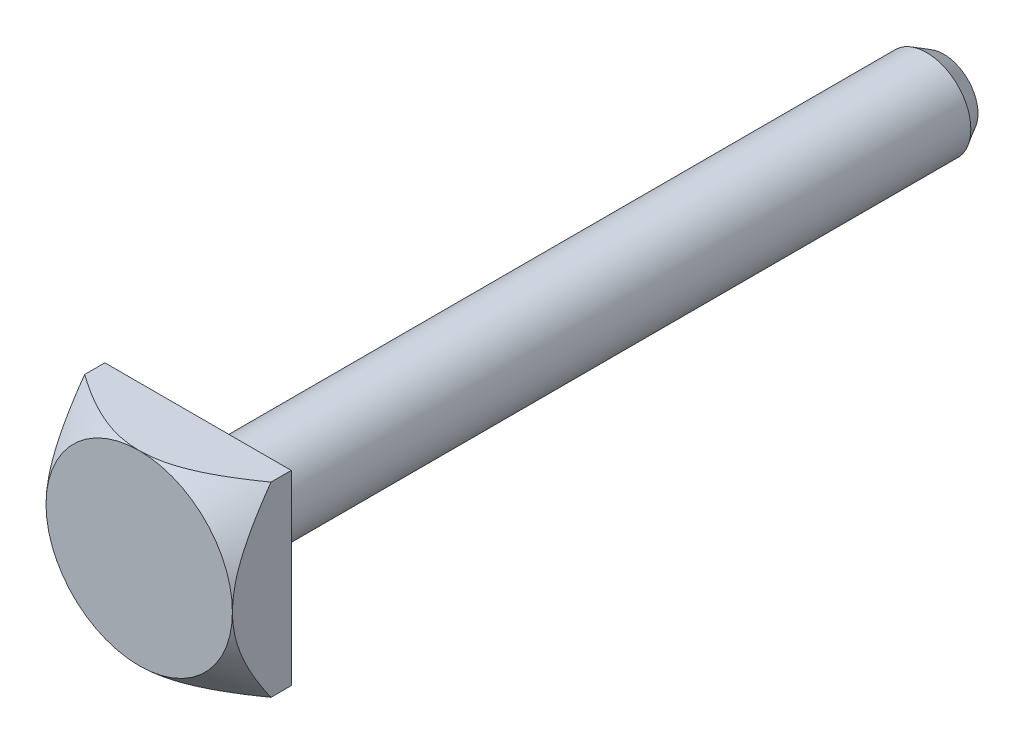
ISO-10303-21;
HEADER;
FILE_DESCRIPTION(('STEP AP214'),'2;1');
FILE_NAME('part.step','',(''),(''),'','','');
FILE_SCHEMA(('AUTOMOTIVE_DESIGN { 1 0 10303 214 1 1 1 1 }'));
ENDSEC;
DATA;
#1=APPLICATION_CONTEXT('core data for automotive mechanical design processes');
#2=APPLICATION_PROTOCOL_DEFINITION('international standard','automotive_design',2000,#1);
#3=PRODUCT_CONTEXT('',#1,'mechanical');
#4=PRODUCT('Part','Part','',(#3));
#5=PRODUCT_RELATED_PRODUCT_CATEGORY('part','',(#4));
#6=PRODUCT_DEFINITION_FORMATION('','',#4);
#7=PRODUCT_DEFINITION_CONTEXT('part definition',#1,'design');
#8=PRODUCT_DEFINITION('design','',#6,#7);
#9=PRODUCT_DEFINITION_SHAPE('','',#8);
#10=(LENGTH_UNIT() NAMED_UNIT(*) SI_UNIT(.MILLI.,.METRE.));
#11=(NAMED_UNIT(*) PLANE_ANGLE_UNIT() SI_UNIT($,.RADIAN.));
#12=(NAMED_UNIT(*) SI_UNIT($,.STERADIAN.) SOLID_ANGLE_UNIT());
#13=UNCERTAINTY_MEASURE_WITH_UNIT(LENGTH_MEASURE(1.E-05),#10,'distance_accuracy_value','');
#14=(GEOMETRIC_REPRESENTATION_CONTEXT(3) GLOBAL_UNCERTAINTY_ASSIGNED_CONTEXT((#13)) GLOBAL_UNIT_ASSIGNED_CONTEXT((#10,
#11,#12)) REPRESENTATION_CONTEXT('',''));
#15=CARTESIAN_POINT('',(0.,0.,0.));
#16=DIRECTION('',(0.,0.,1.));
#17=DIRECTION('',(1.,0.,0.));
#18=AXIS2_PLACEMENT_3D('',#15,#16,#17);
#19=CARTESIAN_POINT('',(9.5,9.5,82.));
#20=DIRECTION('',(-1.,0.,0.));
#21=DIRECTION('',(0.,-1.,0.));
#22=AXIS2_PLACEMENT_3D('',#19,#20,#21);
#23=PLANE('',#22);
#24=CARTESIAN_POINT('',(9.50000000000001,-19.4721665623452,69.8340065856256));
#25=CARTESIAN_POINT('',(9.50000000000001,-19.0306590831264,70.2307531037804));
#26=CARTESIAN_POINT('',(9.50000000000001,-18.5879086587408,70.6261284048615));
#27=CARTESIAN_POINT('',(9.50000000000001,-17.699269950547,71.4134110112182));
#28=CARTESIAN_POINT('',(9.50000000000001,-17.2533814043065,71.8053180201121));
#29=CARTESIAN_POINT('',(9.50000000000001,-16.3563490198093,72.5862116730046));
#30=CARTESIAN_POINT('',(9.50000000000001,-15.905192381029,72.9751836363947));
#31=CARTESIAN_POINT('',(9.50000000000001,-14.9983093091864,73.7477379709349));
#32=CARTESIAN_POINT('',(9.50000000000001,-14.5425830508741,74.1313205468474));
#33=CARTESIAN_POINT('',(9.50000000000001,-13.5993560046381,74.9132893945585));
#34=CARTESIAN_POINT('',(9.50000000000001,-13.1115229732712,75.311275727635));
#35=CARTESIAN_POINT('',(9.50000000000001,-12.1277405329228,76.0972630482586));
#36=CARTESIAN_POINT('',(9.50000000000001,-11.6317902090281,76.4852628973563));
#37=CARTESIAN_POINT('',(9.50000000000001,-10.8804318030354,77.0567459686463));
#38=CARTESIAN_POINT('',(9.50000000000001,-10.6289222453784,77.2453567322921));
#39=CARTESIAN_POINT('',(9.50000000000001,-10.1229368572879,77.6185515664923));
#40=CARTESIAN_POINT('',(9.50000000000001,-9.86846110495942,77.8031357427082));
#41=CARTESIAN_POINT('',(9.50000000000001,-9.35616825008921,78.1675029286436));
#42=CARTESIAN_POINT('',(9.50000000000001,-9.09835184545209,78.3472869179081));
#43=CARTESIAN_POINT('',(9.50000000000001,-8.57884607412315,78.7011557822078));
#44=CARTESIAN_POINT('',(9.50000000000001,-8.31715693942837,78.8752409966391));
#45=CARTESIAN_POINT('',(9.50000000000001,-7.85493474254647,79.1741271671386));
#46=CARTESIAN_POINT('',(9.50000000000001,-7.65536867977937,79.300422734887));
#47=CARTESIAN_POINT('',(9.50000000000001,-7.25345974520725,79.548528323));
#48=CARTESIAN_POINT('',(9.50000000000001,-7.05111686375619,79.6703383277773));
#49=CARTESIAN_POINT('',(9.50000000000001,-6.64328519100776,79.9088024302439));
#50=CARTESIAN_POINT('',(9.50000000000001,-6.43779503233453,80.0254541960909));
#51=CARTESIAN_POINT('',(9.50000000000001,-6.02347517551823,80.2526784688388));
#52=CARTESIAN_POINT('',(9.50000000000001,-5.81464550342015,80.3632510231218));
#53=CARTESIAN_POINT('',(9.50000000000001,-5.39518568595386,80.5763701796043));
#54=CARTESIAN_POINT('',(9.50000000000001,-5.18458695413664,80.6789781744367));
#55=CARTESIAN_POINT('',(9.50000000000001,-4.75961358581539,80.8760428240298));
#56=CARTESIAN_POINT('',(9.5,-4.5452386185349,80.9704987603988));
#57=CARTESIAN_POINT('',(9.5,-3.89645106853887,81.2395148348638));
#58=CARTESIAN_POINT('',(9.5,-3.45591373688126,81.3999642298198));
#59=CARTESIAN_POINT('',(9.5,-2.72872088080816,81.6194537870873));
#60=CARTESIAN_POINT('',(9.5,-2.44669929064959,81.6939169549311));
#61=CARTESIAN_POINT('',(9.5,-1.87758402609192,81.8202054365497));
#62=CARTESIAN_POINT('',(9.5,-1.59049118100718,81.8720344167332));
#63=CARTESIAN_POINT('',(9.5,-1.01382125890937,81.9503108271729));
#64=CARTESIAN_POINT('',(9.5,-0.72425607151271,81.9768446562656));
#65=CARTESIAN_POINT('',(9.5,-0.143893684117631,82.0033318956354));
#66=CARTESIAN_POINT('',(9.5,0.146903499507863,82.0032856580537));
#67=CARTESIAN_POINT('',(9.5,0.727182438330571,81.9766190152951));
#68=CARTESIAN_POINT('',(9.5,1.01666450475548,81.9500052660521));
#69=CARTESIAN_POINT('',(9.5,1.59218911977194,81.8717227256791));
#70=CARTESIAN_POINT('',(9.5,1.87823139125666,81.8200519296499));
#71=CARTESIAN_POINT('',(9.5,2.44645115463409,81.6939819093232));
#72=CARTESIAN_POINT('',(9.5,2.72860744462623,81.6194884074541));
#73=CARTESIAN_POINT('',(9.5,3.28695217314645,81.4509617358665));
#74=CARTESIAN_POINT('',(9.5,3.56314048453642,81.3569281503304));
#75=CARTESIAN_POINT('',(9.5,4.17331405632189,81.1284629056652));
#76=CARTESIAN_POINT('',(9.5,4.50567836116506,80.9897281434871));
#77=CARTESIAN_POINT('',(9.5,5.16145598433046,80.6923571745101));
#78=CARTESIAN_POINT('',(9.5,5.48486474972347,80.5337110637116));
#79=CARTESIAN_POINT('',(9.5,6.12405252036251,80.2004640029442));
#80=CARTESIAN_POINT('',(9.5,6.43981630807762,80.0258340871359));
#81=CARTESIAN_POINT('',(9.5,7.06406026537905,79.6641963182886));
#82=CARTESIAN_POINT('',(9.5,7.37254156146312,79.4771903968892));
#83=CARTESIAN_POINT('',(9.5,7.98758322003159,79.0905886143598));
#84=CARTESIAN_POINT('',(9.5,8.29405479695658,78.8908521584679));
#85=CARTESIAN_POINT('',(9.5,8.90151951083994,78.4832278431503));
#86=CARTESIAN_POINT('',(9.5,9.20251248185393,78.2753397374145));
#87=CARTESIAN_POINT('',(9.5,9.79947230559169,77.8531990855414));
#88=CARTESIAN_POINT('',(9.5,10.095444531443,77.6389541194796));
#89=CARTESIAN_POINT('',(9.5,10.5363932712576,77.3135355358374));
#90=CARTESIAN_POINT('',(9.5,10.6828725828445,77.2043890206315));
#91=CARTESIAN_POINT('',(9.5,10.9749032872221,76.984862019344));
#92=CARTESIAN_POINT('',(9.5,11.120454681983,76.8744815358836));
#93=CARTESIAN_POINT('',(9.5,11.6065777544125,76.5028586450495));
#94=CARTESIAN_POINT('',(9.5,11.9452134973594,76.2390808546953));
#95=CARTESIAN_POINT('',(9.5,12.6185169171593,75.7065015549161));
#96=CARTESIAN_POINT('',(9.5,12.9531844620437,75.4376998791754));
#97=CARTESIAN_POINT('',(9.5,13.6191943851422,74.8959364175296));
#98=CARTESIAN_POINT('',(9.5,13.9505363839072,74.622974165649));
#99=CARTESIAN_POINT('',(9.5,14.6103560118949,74.0736065522171));
#100=CARTESIAN_POINT('',(9.5,14.9388336060367,73.7972011485973));
#101=CARTESIAN_POINT('',(9.5,15.9208670648253,72.9634458981318));
#102=CARTESIAN_POINT('',(9.5,16.5707556933819,72.4017764845088));
#103=CARTESIAN_POINT('',(9.5,17.8632436683412,71.2701125510646));
#104=CARTESIAN_POINT('',(9.5,18.5058428404962,70.7001178329765));
#105=CARTESIAN_POINT('',(9.5,19.4661886226032,69.8398446712375));
#106=CARTESIAN_POINT('',(9.5,19.7860380298136,69.5519086510083));
#107=CARTESIAN_POINT('',(9.5,20.4244843871943,68.9746598078038));
#108=CARTESIAN_POINT('',(9.5,20.743081353806,68.6853470030134));
#109=CARTESIAN_POINT('',(9.5,21.6972332435877,67.8155878429893));
#110=CARTESIAN_POINT('',(9.5,22.3311378989618,67.2333308487522));
#111=CARTESIAN_POINT('',(9.5,23.5952857660785,66.0651964305225));
#112=CARTESIAN_POINT('',(9.5,24.2255299054995,65.4793200090921));
#113=CARTESIAN_POINT('',(9.5,25.4831899525707,64.3045468175269));
#114=CARTESIAN_POINT('',(9.5,26.110605872843,63.7156500608968));
#115=CARTESIAN_POINT('',(9.5,27.8419596603832,62.0842353293462));
#116=CARTESIAN_POINT('',(9.5,28.9434678330272,61.0391394206669));
#117=CARTESIAN_POINT('',(9.5,31.1414108271591,58.9434610486695));
#118=CARTESIAN_POINT('',(9.5,32.2378452406621,57.8928781581157));
#119=CARTESIAN_POINT('',(9.5,34.4229345208861,55.7914702396196));
#120=CARTESIAN_POINT('',(9.5,35.5116031859481,54.7406595533692));
#121=CARTESIAN_POINT('',(9.5,37.1423521564513,53.1622144889063));
#122=CARTESIAN_POINT('',(9.5,37.6855351280304,52.6357183267912));
#123=CARTESIAN_POINT('',(9.5,38.7712471373125,51.582053002208));
#124=CARTESIAN_POINT('',(9.5,39.3137761755314,51.0548838402715));
#125=CARTESIAN_POINT('',(9.5,39.8560191762373,50.527420576969));
#126=B_SPLINE_CURVE_WITH_KNOTS('',3,(#24,#25,#26,#27,#28,#29,#30,#31,#32,#33,#34,#35,#36,#37,
#38,#39,#40,#41,#42,#43,#44,#45,#46,#47,#48,#49,#50,#51,#52,#53,#54,#55,#56,#57,#58,#59,#60,#61,
#62,#63,#64,#65,#66,#67,#68,#69,#70,#71,#72,#73,#74,#75,#76,#77,#78,#79,#80,#81,#82,#83,#84,#85,
#86,#87,#88,#89,#90,#91,#92,#93,#94,#95,#96,#97,#98,#99,#100,#101,#102,#103,#104,#105,#106,#107,
#108,#109,#110,#111,#112,#113,#114,#115,#116,#117,#118,#119,#120,#121,#122,#123,#124,#125),
.UNSPECIFIED.,.F.,.F.,(4,2,2,2,2,2,2,2,2,2,2,2,2,2,2,2,2,2,2,2,2,2,2,2,2,2,2,2,2,2,2,2,2,2,2,2,
2,2,2,2,2,2,2,2,2,2,2,2,2,2,4),(0.,1.7807476632217,3.56164605807489,5.34866975491514,
7.13562537161878,9.02428218811752,10.9131533644821,11.8562443537476,12.7993105655825,
13.7421828375748,14.6849988533453,15.3934650268924,16.1019336621143,16.8107193613365,
17.5194995354079,18.222120744475,18.9248038082128,20.3286106017265,21.2029127147086,
22.0770731509003,22.9482369673734,23.819389242388,24.6903233231945,25.5613271018895,
26.4359785344783,27.3106485817653,28.3902661767405,29.470422922831,30.5525774214235,
31.6345634145055,32.7318431929293,33.8291561523158,34.9252094410886,35.4732209514317,
36.0212312978631,37.3089058230541,38.5966230524468,39.8844855788244,41.1723638558417,
43.7491592389292,46.3260160886862,47.6170963300896,48.9081595658529,51.4903314225004,
54.071817518873,56.653292082908,61.208469999009,65.7640080482459,70.303231317281,
72.5726390920606,74.8420450751079),.UNSPECIFIED.);
#127=CARTESIAN_POINT('',(9.5,-9.5,78.0649711574556));
#128=VERTEX_POINT('',#127);
#129=CARTESIAN_POINT('',(9.5,0.,82.));
#130=VERTEX_POINT('',#129);
#131=EDGE_CURVE('E209',#128,#130,#126,.T.);
#132=ORIENTED_EDGE('',*,*,#131,.F.);
#133=DIRECTION('',(0.,0.,-1.));
#134=VECTOR('',#133,1.);
#135=CARTESIAN_POINT('',(9.50000000000001,-9.5,82.));
#136=LINE('',#135,#134);
#137=CARTESIAN_POINT('',(9.50000000000001,-9.5,76.));
#138=VERTEX_POINT('',#137);
#139=EDGE_CURVE('E199',#128,#138,#136,.T.);
#140=ORIENTED_EDGE('',*,*,#139,.T.);
#141=DIRECTION('',(0.,1.,0.));
#142=VECTOR('',#141,1.);
#143=CARTESIAN_POINT('',(9.5,9.5,76.));
#144=LINE('',#143,#142);
#145=CARTESIAN_POINT('',(9.5,9.5,76.));
#146=VERTEX_POINT('',#145);
#147=EDGE_CURVE('E207',#138,#146,#144,.T.);
#148=ORIENTED_EDGE('',*,*,#147,.T.);
#149=DIRECTION('',(0.,0.,-1.));
#150=VECTOR('',#149,1.);
#151=CARTESIAN_POINT('',(9.5,9.5,82.));
#152=LINE('',#151,#150);
#153=CARTESIAN_POINT('',(9.5,9.5,78.0649711574556));
#154=VERTEX_POINT('',#153);
#155=EDGE_CURVE('E158',#154,#146,#152,.T.);
#156=ORIENTED_EDGE('',*,*,#155,.F.);
#157=EDGE_CURVE('E90',#130,#154,#126,.T.);
#158=ORIENTED_EDGE('',*,*,#157,.F.);
#159=EDGE_LOOP('',(#132,#140,#148,#156,#158));
#160=FACE_BOUND('',#159,.T.);
#161=ADVANCED_FACE('F34',(#160),#23,.F.);
#162=CARTESIAN_POINT('',(-9.5,9.5,82.));
#163=DIRECTION('',(0.,-1.,0.));
#164=DIRECTION('',(0.,0.,-1.));
#165=AXIS2_PLACEMENT_3D('',#162,#163,#164);
#166=PLANE('',#165);
#167=CARTESIAN_POINT('',(-19.4721662367495,9.5,69.8340068782526));
#168=CARTESIAN_POINT('',(-19.0306587695027,9.5,70.2307533843746));
#169=CARTESIAN_POINT('',(-18.5879083571048,9.5,70.6261286734358));
#170=CARTESIAN_POINT('',(-17.6992696729411,9.5,71.4134112557986));
#171=CARTESIAN_POINT('',(-17.253381138743,9.5,71.8053182527185));
#172=CARTESIAN_POINT('',(-16.3563487784739,9.5,72.5862118816675));
#173=CARTESIAN_POINT('',(-15.9051921518799,9.5,72.9751838330885));
#174=CARTESIAN_POINT('',(-14.9983091045179,9.5,73.7477381437991));
#175=CARTESIAN_POINT('',(-14.5425828584999,9.5,74.131320707851));
#176=CARTESIAN_POINT('',(-13.5993558341223,9.5,74.9132895343158));
#177=CARTESIAN_POINT('',(-13.1115228122817,9.5,75.3112758579597));
#178=CARTESIAN_POINT('',(-12.127740391124,9.5,76.0972631598395));
#179=CARTESIAN_POINT('',(-11.631790076894,9.5,76.4852629996262));
#180=CARTESIAN_POINT('',(-10.8804316855481,9.5,77.0567460571285));
#181=CARTESIAN_POINT('',(-10.6289221327915,9.5,77.2453568162139));
#182=CARTESIAN_POINT('',(-10.122936754571,9.5,77.6185516413686));
#183=CARTESIAN_POINT('',(-9.86846100721231,9.5,77.8031358130992));
#184=CARTESIAN_POINT('',(-9.35616816236646,9.5,78.167502990168));
#185=CARTESIAN_POINT('',(-9.09835176278387,9.5,78.3472869750509));
#186=CARTESIAN_POINT('',(-8.57884600167523,9.5,78.7011558307242));
#187=CARTESIAN_POINT('',(-8.31715687214619,9.5,78.8752410409108));
#188=CARTESIAN_POINT('',(-7.85493467103632,9.5,79.1741272128048));
#189=CARTESIAN_POINT('',(-7.65536859867558,9.5,79.3004227858894));
#190=CARTESIAN_POINT('',(-7.25345964461779,9.5,79.5485283841598));
#191=CARTESIAN_POINT('',(-7.05111675327469,9.5,79.6703383937583));
#192=CARTESIAN_POINT('',(-6.64328506038029,9.5,79.9088025052416));
#193=CARTESIAN_POINT('',(-6.43779489145272,9.5,80.0254542752836));
#194=CARTESIAN_POINT('',(-6.02347501374828,9.5,80.2526785556284));
#195=CARTESIAN_POINT('',(-5.81464533101642,9.5,80.3632511133135));
#196=CARTESIAN_POINT('',(-5.39518549248985,9.5,80.5763702753258));
#197=CARTESIAN_POINT('',(-5.18458675025878,9.5,80.6789782723122));
#198=CARTESIAN_POINT('',(-4.75961336071198,9.5,80.8760429250763));
#199=CARTESIAN_POINT('',(-4.54523838261968,9.5,80.9704988624623));
#200=CARTESIAN_POINT('',(-3.89645079968952,9.5,81.2395149378669));
#201=CARTESIAN_POINT('',(-3.45591344527138,9.5,81.3999643307019));
#202=CARTESIAN_POINT('',(-2.728720561896,9.5,81.6194538753387));
#203=CARTESIAN_POINT('',(-2.44669896764992,9.5,81.6939170356891));
#204=CARTESIAN_POINT('',(-1.87758369531981,9.5,81.8202055008759));
#205=CARTESIAN_POINT('',(-1.59049084655016,9.5,81.8720344721218));
#206=CARTESIAN_POINT('',(-1.01382091769355,9.5,81.9503108635402));
#207=CARTESIAN_POINT('',(-0.724255727219079,9.5,81.9768446825428));
#208=CARTESIAN_POINT('',(-0.143893334609152,9.5,82.0033319010263));
#209=CARTESIAN_POINT('',(0.146903851153431,9.5,82.0032856526476));
#210=CARTESIAN_POINT('',(0.727182792411843,9.5,81.9766189882689));
#211=CARTESIAN_POINT('',(1.01666485913918,9.5,81.950005228279));
#212=CARTESIAN_POINT('',(1.59218947393448,9.5,81.8717226670675));
#213=CARTESIAN_POINT('',(1.87823174489549,9.5,81.8200518609465));
#214=CARTESIAN_POINT('',(2.44645150674143,9.5,81.6939818213945));
#215=CARTESIAN_POINT('',(2.7286077957222,9.5,81.6194883103905));
#216=CARTESIAN_POINT('',(3.28695252192376,9.5,81.4509616216795));
#217=CARTESIAN_POINT('',(3.56314083200677,9.5,81.3569280281561));
#218=CARTESIAN_POINT('',(4.17331443672114,9.5,81.1284627534397));
#219=CARTESIAN_POINT('',(4.50567877478219,9.5,80.9897279668201));
#220=CARTESIAN_POINT('',(5.16145646270298,9.5,80.6923569466823));
#221=CARTESIAN_POINT('',(5.48486525963185,9.5,80.5337108091618));
#222=CARTESIAN_POINT('',(6.12405309221407,9.5,80.2004636934879));
#223=CARTESIAN_POINT('',(6.43981691033182,9.5,80.0258337494883));
#224=CARTESIAN_POINT('',(7.06406092749919,9.5,79.6641959234618));
#225=CARTESIAN_POINT('',(7.37254225304698,9.5,79.4771899730752));
#226=CARTESIAN_POINT('',(7.98758397010628,9.5,79.0905881318274));
#227=CARTESIAN_POINT('',(8.29405557605345,9.5,78.8908516462045));
#228=CARTESIAN_POINT('',(8.90152034753673,9.5,78.4832272711794));
#229=CARTESIAN_POINT('',(9.20251334712841,9.5,78.2753391354671));
#230=CARTESIAN_POINT('',(9.79947322763254,9.5,77.8531984236));
#231=CARTESIAN_POINT('',(10.0954454816737,9.5,77.6389534275223));
#232=CARTESIAN_POINT('',(10.5363942636256,9.5,77.3135347988288));
#233=CARTESIAN_POINT('',(10.6828735892338,9.5,77.2043882686011));
#234=CARTESIAN_POINT('',(10.9749043216142,9.5,76.9848612372669));
#235=CARTESIAN_POINT('',(11.1204557303566,9.5,76.8744807387817));
#236=CARTESIAN_POINT('',(11.6065788078486,9.5,76.5028578295125));
#237=CARTESIAN_POINT('',(11.9452145423811,9.5,76.2390800365096));
#238=CARTESIAN_POINT('',(12.6185179461384,9.5,75.7065007325882));
#239=CARTESIAN_POINT('',(12.9531854833945,9.5,75.4376990553543));
#240=CARTESIAN_POINT('',(13.6191953918572,9.5,74.8959355916253));
#241=CARTESIAN_POINT('',(13.9505373836147,9.5,74.6229733391551));
#242=CARTESIAN_POINT('',(14.6103569981068,9.5,74.0736057252422));
#243=CARTESIAN_POINT('',(14.9388345857604,9.5,73.797200321731));
#244=CARTESIAN_POINT('',(15.9208680256002,9.5,72.9634450725066));
#245=CARTESIAN_POINT('',(16.5707566423306,9.5,72.4017756608401));
#246=CARTESIAN_POINT('',(17.8632445947826,9.5,71.2701117327226));
#247=CARTESIAN_POINT('',(18.5058437562566,9.5,70.7001170180049));
#248=CARTESIAN_POINT('',(19.4661895227683,9.5,69.8398438622001));
#249=CARTESIAN_POINT('',(19.7860389247611,9.5,69.5519078441756));
#250=CARTESIAN_POINT('',(20.4244852718828,9.5,68.9746590055837));
#251=CARTESIAN_POINT('',(20.7430822334532,9.5,68.6853462032009));
#252=CARTESIAN_POINT('',(21.6972341083258,9.5,67.8155870506594));
#253=CARTESIAN_POINT('',(22.3311387540529,9.5,67.2333300617519));
#254=CARTESIAN_POINT('',(23.5952866023794,9.5,66.0651956545996));
#255=CARTESIAN_POINT('',(24.2255307326567,9.5,65.4793192389164));
#256=CARTESIAN_POINT('',(25.4831907617642,9.5,64.3045460592019));
#257=CARTESIAN_POINT('',(26.1106066732164,9.5,63.7156493086751));
#258=CARTESIAN_POINT('',(27.8419604615082,9.5,62.084234571));
#259=CARTESIAN_POINT('',(28.9434686438209,9.5,61.0391386502046));
#260=CARTESIAN_POINT('',(31.141411657545,9.5,58.9434602543247));
#261=CARTESIAN_POINT('',(32.2378460809715,9.5,57.8928773520049));
#262=CARTESIAN_POINT('',(34.422935382294,9.5,55.7914694091909));
#263=CARTESIAN_POINT('',(35.5116040585264,9.5,54.740658710384));
#264=CARTESIAN_POINT('',(37.1423530459074,9.5,53.1622136271789));
#265=CARTESIAN_POINT('',(37.6855360231419,9.5,52.635717458823));
#266=CARTESIAN_POINT('',(38.7712480437648,9.5,51.5820521217898));
#267=CARTESIAN_POINT('',(39.313777087669,9.5,51.0548829536442));
#268=CARTESIAN_POINT('',(39.8560200940728,9.5,50.5274196841457));
#269=B_SPLINE_CURVE_WITH_KNOTS('',3,(#167,#168,#169,#170,#171,#172,#173,#174,#175,#176,#177,
#178,#179,#180,#181,#182,#183,#184,#185,#186,#187,#188,#189,#190,#191,#192,#193,#194,#195,#196,
#197,#198,#199,#200,#201,#202,#203,#204,#205,#206,#207,#208,#209,#210,#211,#212,#213,#214,#215,
#216,#217,#218,#219,#220,#221,#222,#223,#224,#225,#226,#227,#228,#229,#230,#231,#232,#233,#234,
#235,#236,#237,#238,#239,#240,#241,#242,#243,#244,#245,#246,#247,#248,#249,#250,#251,#252,#253,
#254,#255,#256,#257,#258,#259,#260,#261,#262,#263,#264,#265,#266,#267,#268),.UNSPECIFIED.,.F.,
.F.,(4,2,2,2,2,2,2,2,2,2,2,2,2,2,2,2,2,2,2,2,2,2,2,2,2,2,2,2,2,2,2,2,2,2,2,2,2,2,2,2,2,2,2,2,2,
2,2,2,2,2,4),(0.,1.78074761237893,3.56164595638186,5.34866960208711,7.13562516766091,
9.02428194412704,10.9131530804465,11.8562440497432,12.7993102416101,13.7421824936468,
14.6849984894656,15.3934646958844,16.1019333639783,16.8107190961482,17.5194993031654,
18.2221205431094,18.924803637738,20.3286104925706,21.2029126115842,22.0770730537911,
22.9482368766244,23.8193891580274,24.6903232427228,25.56132702532,26.4359784620459,
27.3106485134191,28.3902662284354,29.4704230947187,30.5525777140306,31.634563827774,
32.7318437278412,33.8291568088815,34.9252102189652,35.4732217899652,36.0212321970543,
37.3089067072438,38.5966239216145,39.8844864329023,41.1723646948232,43.7491600472681,
46.3260168663584,47.6170970917041,48.9081603114159,51.4903321359388,54.0718182004839,
56.6532927326966,61.2084706948621,65.7640087900169,70.3032321093256,72.5726399093185,
74.8420459175794),.UNSPECIFIED.);
#270=CARTESIAN_POINT('',(0.,9.5,82.));
#271=VERTEX_POINT('',#270);
#272=EDGE_CURVE('E86',#154,#271,#269,.F.);
#273=ORIENTED_EDGE('',*,*,#272,.F.);
#274=ORIENTED_EDGE('',*,*,#155,.T.);
#275=DIRECTION('',(-1.,0.,0.));
#276=VECTOR('',#275,1.);
#277=CARTESIAN_POINT('',(-9.5,9.5,76.));
#278=LINE('',#277,#276);
#279=CARTESIAN_POINT('',(-9.5,9.5,76.));
#280=VERTEX_POINT('',#279);
#281=EDGE_CURVE('E206',#146,#280,#278,.T.);
#282=ORIENTED_EDGE('',*,*,#281,.T.);
#283=DIRECTION('',(0.,0.,-1.));
#284=VECTOR('',#283,1.);
#285=CARTESIAN_POINT('',(-9.5,9.5,82.));
#286=LINE('',#285,#284);
#287=CARTESIAN_POINT('',(-9.5,9.5,78.0649711574556));
#288=VERTEX_POINT('',#287);
#289=EDGE_CURVE('E107',#288,#280,#286,.T.);
#290=ORIENTED_EDGE('',*,*,#289,.F.);
#291=EDGE_CURVE('E94',#271,#288,#269,.F.);
#292=ORIENTED_EDGE('',*,*,#291,.F.);
#293=EDGE_LOOP('',(#273,#274,#282,#290,#292));
#294=FACE_BOUND('',#293,.T.);
#295=ADVANCED_FACE('F105',(#294),#166,.F.);
#296=CARTESIAN_POINT('',(-9.5,9.5,82.));
#297=DIRECTION('',(1.,0.,0.));
#298=DIRECTION('',(0.,1.,0.));
#299=AXIS2_PLACEMENT_3D('',#296,#297,#298);
#300=PLANE('',#299);
#301=CARTESIAN_POINT('',(-9.49999999999999,-19.4721662367495,69.8340068782526));
#302=CARTESIAN_POINT('',(-9.49999999999999,-19.0306587695027,70.2307533843746));
#303=CARTESIAN_POINT('',(-9.49999999999999,-18.5879083571048,70.6261286734358));
#304=CARTESIAN_POINT('',(-9.49999999999999,-17.6992696729411,71.4134112557986));
#305=CARTESIAN_POINT('',(-9.49999999999999,-17.2533811387431,71.8053182527185));
#306=CARTESIAN_POINT('',(-9.49999999999999,-16.3563487784739,72.5862118816675));
#307=CARTESIAN_POINT('',(-9.49999999999999,-15.9051921518799,72.9751838330885));
#308=CARTESIAN_POINT('',(-9.49999999999999,-14.9983091045179,73.7477381437991));
#309=CARTESIAN_POINT('',(-9.49999999999999,-14.5425828584999,74.131320707851));
#310=CARTESIAN_POINT('',(-9.49999999999999,-13.5993558341223,74.9132895343158));
#311=CARTESIAN_POINT('',(-9.49999999999999,-13.1115228122817,75.3112758579597));
#312=CARTESIAN_POINT('',(-9.49999999999999,-12.127740391124,76.0972631598395));
#313=CARTESIAN_POINT('',(-9.49999999999999,-11.631790076894,76.4852629996262));
#314=CARTESIAN_POINT('',(-9.49999999999999,-10.8804316855481,77.0567460571285));
#315=CARTESIAN_POINT('',(-9.49999999999999,-10.6289221327915,77.2453568162139));
#316=CARTESIAN_POINT('',(-9.49999999999999,-10.122936754571,77.6185516413685));
#317=CARTESIAN_POINT('',(-9.49999999999999,-9.86846100721232,77.8031358130992));
#318=CARTESIAN_POINT('',(-9.49999999999999,-9.35616816236647,78.167502990168));
#319=CARTESIAN_POINT('',(-9.49999999999999,-9.09835176278389,78.3472869750509));
#320=CARTESIAN_POINT('',(-9.49999999999999,-8.57884600167524,78.7011558307242));
#321=CARTESIAN_POINT('',(-9.49999999999999,-8.3171568721462,78.8752410409108));
#322=CARTESIAN_POINT('',(-9.49999999999999,-7.85493467103632,79.1741272128048));
#323=CARTESIAN_POINT('',(-9.49999999999999,-7.65536859867558,79.3004227858894));
#324=CARTESIAN_POINT('',(-9.49999999999999,-7.25345964461779,79.5485283841598));
#325=CARTESIAN_POINT('',(-9.49999999999999,-7.05111675327469,79.6703383937583));
#326=CARTESIAN_POINT('',(-9.49999999999999,-6.6432850603803,79.9088025052416));
#327=CARTESIAN_POINT('',(-9.49999999999999,-6.43779489145272,80.0254542752836));
#328=CARTESIAN_POINT('',(-9.49999999999999,-6.02347501374829,80.2526785556284));
#329=CARTESIAN_POINT('',(-9.49999999999999,-5.81464533101642,80.3632511133135));
#330=CARTESIAN_POINT('',(-9.49999999999999,-5.39518549248985,80.5763702753258));
#331=CARTESIAN_POINT('',(-9.49999999999999,-5.18458675025878,80.6789782723122));
#332=CARTESIAN_POINT('',(-9.49999999999999,-4.75961336071198,80.8760429250763));
#333=CARTESIAN_POINT('',(-9.5,-4.54523838261968,80.9704988624623));
#334=CARTESIAN_POINT('',(-9.5,-3.89645079968952,81.2395149378669));
#335=CARTESIAN_POINT('',(-9.5,-3.45591344527138,81.3999643307019));
#336=CARTESIAN_POINT('',(-9.5,-2.728720561896,81.6194538753387));
#337=CARTESIAN_POINT('',(-9.5,-2.44669896764992,81.6939170356891));
#338=CARTESIAN_POINT('',(-9.5,-1.87758369531981,81.8202055008759));
#339=CARTESIAN_POINT('',(-9.5,-1.59049084655016,81.8720344721218));
#340=CARTESIAN_POINT('',(-9.5,-1.01382091769355,81.9503108635402));
#341=CARTESIAN_POINT('',(-9.5,-0.724255727219079,81.9768446825428));
#342=CARTESIAN_POINT('',(-9.5,-0.143893334609152,82.0033319010263));
#343=CARTESIAN_POINT('',(-9.5,0.146903851153431,82.0032856526476));
#344=CARTESIAN_POINT('',(-9.5,0.727182792411842,81.9766189882689));
#345=CARTESIAN_POINT('',(-9.5,1.01666485913918,81.950005228279));
#346=CARTESIAN_POINT('',(-9.5,1.59218947393448,81.8717226670675));
#347=CARTESIAN_POINT('',(-9.5,1.87823174489549,81.8200518609465));
#348=CARTESIAN_POINT('',(-9.5,2.44645150674143,81.6939818213945));
#349=CARTESIAN_POINT('',(-9.5,2.7286077957222,81.6194883103905));
#350=CARTESIAN_POINT('',(-9.5,3.28695252192376,81.4509616216795));
#351=CARTESIAN_POINT('',(-9.5,3.56314083200677,81.3569280281561));
#352=CARTESIAN_POINT('',(-9.5,4.17331443672114,81.1284627534397));
#353=CARTESIAN_POINT('',(-9.5,4.50567877478219,80.9897279668201));
#354=CARTESIAN_POINT('',(-9.5,5.16145646270297,80.6923569466823));
#355=CARTESIAN_POINT('',(-9.5,5.48486525963185,80.5337108091618));
#356=CARTESIAN_POINT('',(-9.5,6.12405309221407,80.2004636934879));
#357=CARTESIAN_POINT('',(-9.5,6.43981691033182,80.0258337494883));
#358=CARTESIAN_POINT('',(-9.5,7.06406092749919,79.6641959234618));
#359=CARTESIAN_POINT('',(-9.5,7.37254225304699,79.4771899730752));
#360=CARTESIAN_POINT('',(-9.5,7.98758397010629,79.0905881318274));
#361=CARTESIAN_POINT('',(-9.5,8.29405557605345,78.8908516462045));
#362=CARTESIAN_POINT('',(-9.5,8.90152034753673,78.4832272711794));
#363=CARTESIAN_POINT('',(-9.5,9.20251334712842,78.2753391354671));
#364=CARTESIAN_POINT('',(-9.5,9.79947322763255,77.8531984236));
#365=CARTESIAN_POINT('',(-9.5,10.0954454816737,77.6389534275223));
#366=CARTESIAN_POINT('',(-9.5,10.5363942636256,77.3135347988288));
#367=CARTESIAN_POINT('',(-9.5,10.6828735892338,77.2043882686011));
#368=CARTESIAN_POINT('',(-9.5,10.9749043216142,76.9848612372669));
#369=CARTESIAN_POINT('',(-9.5,11.1204557303566,76.8744807387817));
#370=CARTESIAN_POINT('',(-9.5,11.6065788078486,76.5028578295125));
#371=CARTESIAN_POINT('',(-9.5,11.9452145423811,76.2390800365096));
#372=CARTESIAN_POINT('',(-9.5,12.6185179461384,75.7065007325882));
#373=CARTESIAN_POINT('',(-9.5,12.9531854833945,75.4376990553543));
#374=CARTESIAN_POINT('',(-9.5,13.6191953918572,74.8959355916253));
#375=CARTESIAN_POINT('',(-9.5,13.9505373836147,74.6229733391551));
#376=CARTESIAN_POINT('',(-9.5,14.6103569981068,74.0736057252422));
#377=CARTESIAN_POINT('',(-9.5,14.9388345857604,73.7972003217309));
#378=CARTESIAN_POINT('',(-9.5,15.9208680256002,72.9634450725066));
#379=CARTESIAN_POINT('',(-9.5,16.5707566423306,72.4017756608401));
#380=CARTESIAN_POINT('',(-9.5,17.8632445947826,71.2701117327226));
#381=CARTESIAN_POINT('',(-9.5,18.5058437562566,70.7001170180049));
#382=CARTESIAN_POINT('',(-9.5,19.4661895227683,69.8398438622001));
#383=CARTESIAN_POINT('',(-9.5,19.7860389247611,69.5519078441756));
#384=CARTESIAN_POINT('',(-9.5,20.4244852718828,68.9746590055837));
#385=CARTESIAN_POINT('',(-9.5,20.7430822334532,68.6853462032009));
#386=CARTESIAN_POINT('',(-9.5,21.6972341083258,67.8155870506594));
#387=CARTESIAN_POINT('',(-9.5,22.3311387540529,67.2333300617519));
#388=CARTESIAN_POINT('',(-9.5,23.5952866023794,66.0651956545996));
#389=CARTESIAN_POINT('',(-9.5,24.2255307326567,65.4793192389164));
#390=CARTESIAN_POINT('',(-9.5,25.4831907617642,64.3045460592019));
#391=CARTESIAN_POINT('',(-9.5,26.1106066732165,63.7156493086751));
#392=CARTESIAN_POINT('',(-9.5,27.8419604615082,62.084234571));
#393=CARTESIAN_POINT('',(-9.5,28.943468643821,61.0391386502046));
#394=CARTESIAN_POINT('',(-9.5,31.141411657545,58.9434602543247));
#395=CARTESIAN_POINT('',(-9.5,32.2378460809715,57.8928773520049));
#396=CARTESIAN_POINT('',(-9.5,34.422935382294,55.7914694091909));
#397=CARTESIAN_POINT('',(-9.5,35.5116040585264,54.740658710384));
#398=CARTESIAN_POINT('',(-9.5,37.1423530459074,53.1622136271789));
#399=CARTESIAN_POINT('',(-9.5,37.6855360231419,52.635717458823));
#400=CARTESIAN_POINT('',(-9.5,38.7712480437648,51.5820521217898));
#401=CARTESIAN_POINT('',(-9.5,39.313777087669,51.0548829536442));
#402=CARTESIAN_POINT('',(-9.5,39.8560200940728,50.5274196841457));
#403=B_SPLINE_CURVE_WITH_KNOTS('',3,(#301,#302,#303,#304,#305,#306,#307,#308,#309,#310,#311,
#312,#313,#314,#315,#316,#317,#318,#319,#320,#321,#322,#323,#324,#325,#326,#327,#328,#329,#330,
#331,#332,#333,#334,#335,#336,#337,#338,#339,#340,#341,#342,#343,#344,#345,#346,#347,#348,#349,
#350,#351,#352,#353,#354,#355,#356,#357,#358,#359,#360,#361,#362,#363,#364,#365,#366,#367,#368,
#369,#370,#371,#372,#373,#374,#375,#376,#377,#378,#379,#380,#381,#382,#383,#384,#385,#386,#387,
#388,#389,#390,#391,#392,#393,#394,#395,#396,#397,#398,#399,#400,#401,#402),.UNSPECIFIED.,.F.,
.F.,(4,2,2,2,2,2,2,2,2,2,2,2,2,2,2,2,2,2,2,2,2,2,2,2,2,2,2,2,2,2,2,2,2,2,2,2,2,2,2,2,2,2,2,2,2,
2,2,2,2,2,4),(0.,1.78074761237892,3.56164595638183,5.34866960208709,7.13562516766089,
9.02428194412705,10.9131530804466,11.8562440497432,12.79931024161,13.7421824936468,
14.6849984894656,15.3934646958844,16.1019333639783,16.8107190961482,17.5194993031654,
18.2221205431094,18.924803637738,20.3286104925706,21.2029126115842,22.0770730537911,
22.9482368766244,23.8193891580274,24.6903232427228,25.56132702532,26.4359784620459,
27.3106485134191,28.3902662284354,29.4704230947187,30.5525777140306,31.6345638277741,
32.7318437278413,33.8291568088815,34.9252102189652,35.4732217899652,36.0212321970543,
37.3089067072438,38.5966239216145,39.8844864329023,41.1723646948233,43.7491600472681,
46.3260168663584,47.6170970917041,48.9081603114159,51.4903321359388,54.0718182004839,
56.6532927326967,61.2084706948621,65.7640087900169,70.3032321093256,72.5726399093185,
74.8420459175794),.UNSPECIFIED.);
#404=CARTESIAN_POINT('',(-9.5,0.,82.));
#405=VERTEX_POINT('',#404);
#406=EDGE_CURVE('E99',#288,#405,#403,.F.);
#407=ORIENTED_EDGE('',*,*,#406,.F.);
#408=ORIENTED_EDGE('',*,*,#289,.T.);
#409=DIRECTION('',(0.,-1.,0.));
#410=VECTOR('',#409,1.);
#411=CARTESIAN_POINT('',(-9.5,9.5,76.));
#412=LINE('',#411,#410);
#413=CARTESIAN_POINT('',(-9.49999999999999,-9.5,76.));
#414=VERTEX_POINT('',#413);
#415=EDGE_CURVE('E197',#280,#414,#412,.T.);
#416=ORIENTED_EDGE('',*,*,#415,.T.);
#417=DIRECTION('',(0.,0.,-1.));
#418=VECTOR('',#417,1.);
#419=CARTESIAN_POINT('',(-9.49999999999999,-9.5,82.));
#420=LINE('',#419,#418);
#421=CARTESIAN_POINT('',(-9.49999999999999,-9.5,78.0649711574556));
#422=VERTEX_POINT('',#421);
#423=EDGE_CURVE('E193',#422,#414,#420,.T.);
#424=ORIENTED_EDGE('',*,*,#423,.F.);
#425=EDGE_CURVE('E108',#405,#422,#403,.F.);
#426=ORIENTED_EDGE('',*,*,#425,.F.);
#427=EDGE_LOOP('',(#407,#408,#416,#424,#426));
#428=FACE_BOUND('',#427,.T.);
#429=ADVANCED_FACE('F131',(#428),#300,.F.);
#430=CARTESIAN_POINT('',(-9.49999999999999,-9.5,82.));
#431=DIRECTION('',(0.,1.,0.));
#432=DIRECTION('',(0.,0.,1.));
#433=AXIS2_PLACEMENT_3D('',#430,#431,#432);
#434=PLANE('',#433);
#435=CARTESIAN_POINT('',(-19.4721662367495,-9.5,69.8340068782526));
#436=CARTESIAN_POINT('',(-19.0306587695027,-9.5,70.2307533843746));
#437=CARTESIAN_POINT('',(-18.5879083571048,-9.5,70.6261286734358));
#438=CARTESIAN_POINT('',(-17.6992696729411,-9.5,71.4134112557986));
#439=CARTESIAN_POINT('',(-17.253381138743,-9.5,71.8053182527185));
#440=CARTESIAN_POINT('',(-16.3563487784739,-9.5,72.5862118816675));
#441=CARTESIAN_POINT('',(-15.9051921518799,-9.5,72.9751838330885));
#442=CARTESIAN_POINT('',(-14.9983091045179,-9.5,73.7477381437991));
#443=CARTESIAN_POINT('',(-14.5425828584999,-9.5,74.131320707851));
#444=CARTESIAN_POINT('',(-13.5993558341223,-9.5,74.9132895343158));
#445=CARTESIAN_POINT('',(-13.1115228122817,-9.5,75.3112758579597));
#446=CARTESIAN_POINT('',(-12.127740391124,-9.5,76.0972631598395));
#447=CARTESIAN_POINT('',(-11.631790076894,-9.5,76.4852629996262));
#448=CARTESIAN_POINT('',(-10.8804316855481,-9.5,77.0567460571285));
#449=CARTESIAN_POINT('',(-10.6289221327915,-9.5,77.2453568162139));
#450=CARTESIAN_POINT('',(-10.122936754571,-9.5,77.6185516413686));
#451=CARTESIAN_POINT('',(-9.86846100721232,-9.5,77.8031358130992));
#452=CARTESIAN_POINT('',(-9.35616816236647,-9.5,78.167502990168));
#453=CARTESIAN_POINT('',(-9.09835176278388,-9.5,78.3472869750509));
#454=CARTESIAN_POINT('',(-8.57884600167523,-9.5,78.7011558307242));
#455=CARTESIAN_POINT('',(-8.31715687214619,-9.5,78.8752410409108));
#456=CARTESIAN_POINT('',(-7.85493467103632,-9.5,79.1741272128048));
#457=CARTESIAN_POINT('',(-7.65536859867558,-9.5,79.3004227858894));
#458=CARTESIAN_POINT('',(-7.25345964461778,-9.5,79.5485283841598));
#459=CARTESIAN_POINT('',(-7.05111675327469,-9.5,79.6703383937583));
#460=CARTESIAN_POINT('',(-6.64328506038029,-9.5,79.9088025052416));
#461=CARTESIAN_POINT('',(-6.43779489145271,-9.5,80.0254542752836));
#462=CARTESIAN_POINT('',(-6.02347501374828,-9.5,80.2526785556284));
#463=CARTESIAN_POINT('',(-5.81464533101642,-9.5,80.3632511133135));
#464=CARTESIAN_POINT('',(-5.39518549248985,-9.5,80.5763702753258));
#465=CARTESIAN_POINT('',(-5.18458675025878,-9.5,80.6789782723122));
#466=CARTESIAN_POINT('',(-4.75961336071198,-9.5,80.8760429250763));
#467=CARTESIAN_POINT('',(-4.54523838261969,-9.5,80.9704988624623));
#468=CARTESIAN_POINT('',(-3.89645079968953,-9.5,81.2395149378669));
#469=CARTESIAN_POINT('',(-3.45591344527138,-9.5,81.3999643307019));
#470=CARTESIAN_POINT('',(-2.728720561896,-9.5,81.6194538753387));
#471=CARTESIAN_POINT('',(-2.44669896764992,-9.5,81.6939170356891));
#472=CARTESIAN_POINT('',(-1.87758369531981,-9.5,81.8202055008759));
#473=CARTESIAN_POINT('',(-1.59049084655017,-9.5,81.8720344721218));
#474=CARTESIAN_POINT('',(-1.01382091769356,-9.5,81.9503108635402));
#475=CARTESIAN_POINT('',(-0.724255727219083,-9.5,81.9768446825428));
#476=CARTESIAN_POINT('',(-0.143893334609157,-9.5,82.0033319010263));
#477=CARTESIAN_POINT('',(0.146903851153426,-9.5,82.0032856526476));
#478=CARTESIAN_POINT('',(0.727182792411837,-9.5,81.9766189882689));
#479=CARTESIAN_POINT('',(1.01666485913918,-9.5,81.950005228279));
#480=CARTESIAN_POINT('',(1.59218947393447,-9.5,81.8717226670675));
#481=CARTESIAN_POINT('',(1.87823174489549,-9.5,81.8200518609465));
#482=CARTESIAN_POINT('',(2.44645150674143,-9.5,81.6939818213945));
#483=CARTESIAN_POINT('',(2.7286077957222,-9.5,81.6194883103905));
#484=CARTESIAN_POINT('',(3.28695252192375,-9.5,81.4509616216795));
#485=CARTESIAN_POINT('',(3.56314083200676,-9.5,81.3569280281561));
#486=CARTESIAN_POINT('',(4.17331443672114,-9.5,81.1284627534397));
#487=CARTESIAN_POINT('',(4.50567877478219,-9.5,80.9897279668201));
#488=CARTESIAN_POINT('',(5.16145646270298,-9.5,80.6923569466823));
#489=CARTESIAN_POINT('',(5.48486525963185,-9.5,80.5337108091618));
#490=CARTESIAN_POINT('',(6.12405309221407,-9.5,80.2004636934879));
#491=CARTESIAN_POINT('',(6.43981691033182,-9.5,80.0258337494883));
#492=CARTESIAN_POINT('',(7.0640609274992,-9.5,79.6641959234618));
#493=CARTESIAN_POINT('',(7.37254225304699,-9.5,79.4771899730752));
#494=CARTESIAN_POINT('',(7.98758397010629,-9.5,79.0905881318274));
#495=CARTESIAN_POINT('',(8.29405557605346,-9.5,78.8908516462045));
#496=CARTESIAN_POINT('',(8.90152034753674,-9.5,78.4832272711794));
#497=CARTESIAN_POINT('',(9.20251334712842,-9.5,78.2753391354671));
#498=CARTESIAN_POINT('',(9.79947322763255,-9.5,77.8531984236));
#499=CARTESIAN_POINT('',(10.0954454816737,-9.5,77.6389534275223));
#500=CARTESIAN_POINT('',(10.5363942636256,-9.5,77.3135347988288));
#501=CARTESIAN_POINT('',(10.6828735892338,-9.5,77.2043882686011));
#502=CARTESIAN_POINT('',(10.9749043216142,-9.5,76.9848612372669));
#503=CARTESIAN_POINT('',(11.1204557303565,-9.5,76.8744807387817));
#504=CARTESIAN_POINT('',(11.6065788078486,-9.5,76.5028578295125));
#505=CARTESIAN_POINT('',(11.9452145423811,-9.5,76.2390800365096));
#506=CARTESIAN_POINT('',(12.6185179461384,-9.5,75.7065007325882));
#507=CARTESIAN_POINT('',(12.9531854833945,-9.5,75.4376990553543));
#508=CARTESIAN_POINT('',(13.6191953918572,-9.5,74.8959355916253));
#509=CARTESIAN_POINT('',(13.9505373836147,-9.5,74.6229733391551));
#510=CARTESIAN_POINT('',(14.6103569981068,-9.5,74.0736057252422));
#511=CARTESIAN_POINT('',(14.9388345857604,-9.5,73.7972003217309));
#512=CARTESIAN_POINT('',(15.9208680256002,-9.5,72.9634450725066));
#513=CARTESIAN_POINT('',(16.5707566423306,-9.5,72.4017756608401));
#514=CARTESIAN_POINT('',(17.8632445947826,-9.5,71.2701117327226));
#515=CARTESIAN_POINT('',(18.5058437562566,-9.5,70.7001170180049));
#516=CARTESIAN_POINT('',(19.4661895227683,-9.5,69.8398438622001));
#517=CARTESIAN_POINT('',(19.7860389247611,-9.5,69.5519078441756));
#518=CARTESIAN_POINT('',(20.4244852718828,-9.5,68.9746590055837));
#519=CARTESIAN_POINT('',(20.7430822334532,-9.5,68.6853462032009));
#520=CARTESIAN_POINT('',(21.6972341083258,-9.5,67.8155870506594));
#521=CARTESIAN_POINT('',(22.3311387540529,-9.5,67.2333300617519));
#522=CARTESIAN_POINT('',(23.5952866023794,-9.5,66.0651956545996));
#523=CARTESIAN_POINT('',(24.2255307326567,-9.5,65.4793192389164));
#524=CARTESIAN_POINT('',(25.4831907617642,-9.5,64.3045460592019));
#525=CARTESIAN_POINT('',(26.1106066732164,-9.5,63.7156493086751));
#526=CARTESIAN_POINT('',(27.8419604615082,-9.5,62.084234571));
#527=CARTESIAN_POINT('',(28.9434686438209,-9.5,61.0391386502046));
#528=CARTESIAN_POINT('',(31.141411657545,-9.5,58.9434602543247));
#529=CARTESIAN_POINT('',(32.2378460809715,-9.5,57.8928773520049));
#530=CARTESIAN_POINT('',(34.422935382294,-9.5,55.7914694091909));
#531=CARTESIAN_POINT('',(35.5116040585264,-9.5,54.740658710384));
#532=CARTESIAN_POINT('',(37.1423530459074,-9.5,53.1622136271789));
#533=CARTESIAN_POINT('',(37.6855360231419,-9.5,52.635717458823));
#534=CARTESIAN_POINT('',(38.7712480437648,-9.5,51.5820521217898));
#535=CARTESIAN_POINT('',(39.313777087669,-9.5,51.0548829536442));
#536=CARTESIAN_POINT('',(39.8560200940728,-9.5,50.5274196841457));
#537=B_SPLINE_CURVE_WITH_KNOTS('',3,(#435,#436,#437,#438,#439,#440,#441,#442,#443,#444,#445,
#446,#447,#448,#449,#450,#451,#452,#453,#454,#455,#456,#457,#458,#459,#460,#461,#462,#463,#464,
#465,#466,#467,#468,#469,#470,#471,#472,#473,#474,#475,#476,#477,#478,#479,#480,#481,#482,#483,
#484,#485,#486,#487,#488,#489,#490,#491,#492,#493,#494,#495,#496,#497,#498,#499,#500,#501,#502,
#503,#504,#505,#506,#507,#508,#509,#510,#511,#512,#513,#514,#515,#516,#517,#518,#519,#520,#521,
#522,#523,#524,#525,#526,#527,#528,#529,#530,#531,#532,#533,#534,#535,#536),.UNSPECIFIED.,.F.,
.F.,(4,2,2,2,2,2,2,2,2,2,2,2,2,2,2,2,2,2,2,2,2,2,2,2,2,2,2,2,2,2,2,2,2,2,2,2,2,2,2,2,2,2,2,2,2,
2,2,2,2,2,4),(0.,1.78074761237892,3.56164595638186,5.3486696020871,7.13562516766091,
9.02428194412704,10.9131530804465,11.8562440497432,12.79931024161,13.7421824936468,
14.6849984894656,15.3934646958844,16.1019333639783,16.8107190961482,17.5194993031654,
18.2221205431094,18.924803637738,20.3286104925706,21.2029126115842,22.0770730537911,
22.9482368766244,23.8193891580274,24.6903232427228,25.56132702532,26.4359784620459,
27.310648513419,28.3902662284354,29.4704230947187,30.5525777140306,31.6345638277741,
32.7318437278413,33.8291568088815,34.9252102189652,35.4732217899652,36.0212321970543,
37.3089067072438,38.5966239216145,39.8844864329023,41.1723646948233,43.7491600472681,
46.3260168663584,47.6170970917041,48.9081603114159,51.4903321359388,54.0718182004839,
56.6532927326967,61.2084706948621,65.7640087900169,70.3032321093257,72.5726399093185,
74.8420459175794),.UNSPECIFIED.);
#538=CARTESIAN_POINT('',(0.,-9.5,82.));
#539=VERTEX_POINT('',#538);
#540=EDGE_CURVE('E184',#422,#539,#537,.T.);
#541=ORIENTED_EDGE('',*,*,#540,.F.);
#542=ORIENTED_EDGE('',*,*,#423,.T.);
#543=DIRECTION('',(1.,0.,0.));
#544=VECTOR('',#543,1.);
#545=CARTESIAN_POINT('',(-9.49999999999999,-9.5,76.));
#546=LINE('',#545,#544);
#547=EDGE_CURVE('E201',#414,#138,#546,.T.);
#548=ORIENTED_EDGE('',*,*,#547,.T.);
#549=ORIENTED_EDGE('',*,*,#139,.F.);
#550=EDGE_CURVE('E102',#539,#128,#537,.T.);
#551=ORIENTED_EDGE('',*,*,#550,.F.);
#552=EDGE_LOOP('',(#541,#542,#548,#549,#551));
#553=FACE_BOUND('',#552,.T.);
#554=ADVANCED_FACE('F144',(#553),#434,.F.);
#555=CARTESIAN_POINT('',(0.,0.,76.));
#556=DIRECTION('',(0.,0.,-1.));
#557=DIRECTION('',(-1.,0.,0.));
#558=AXIS2_PLACEMENT_3D('',#555,#556,#557);
#559=CYLINDRICAL_SURFACE('',#558,4.5);
#560=CARTESIAN_POINT('',(0.,0.,1.73205080756886));
#561=DIRECTION('',(0.,0.,1.));
#562=DIRECTION('',(1.,0.,0.));
#563=AXIS2_PLACEMENT_3D('',#560,#561,#562);
#564=CIRCLE('',#563,4.5);
#565=CARTESIAN_POINT('',(4.5,0.,1.73205080756886));
#566=VERTEX_POINT('',#565);
#567=EDGE_CURVE('E153',#566,#566,#564,.T.);
#568=ORIENTED_EDGE('',*,*,#567,.T.);
#569=EDGE_LOOP('',(#568));
#570=FACE_BOUND('',#569,.T.);
#571=CARTESIAN_POINT('',(0.,0.,76.));
#572=DIRECTION('',(0.,0.,1.));
#573=DIRECTION('',(1.,0.,0.));
#574=AXIS2_PLACEMENT_3D('',#571,#572,#573);
#575=CIRCLE('',#574,4.5);
#576=CARTESIAN_POINT('',(4.5,0.,76.));
#577=VERTEX_POINT('',#576);
#578=EDGE_CURVE('E156',#577,#577,#575,.T.);
#579=ORIENTED_EDGE('',*,*,#578,.F.);
#580=EDGE_LOOP('',(#579));
#581=FACE_BOUND('',#580,.T.);
#582=ADVANCED_FACE('F141',(#570,#581),#559,.T.);
#583=CARTESIAN_POINT('',(0.,0.,0.));
#584=DIRECTION('',(0.,0.,1.));
#585=DIRECTION('',(1.,0.,0.));
#586=AXIS2_PLACEMENT_3D('',#583,#584,#585);
#587=PLANE('',#586);
#588=CARTESIAN_POINT('',(0.,0.,0.));
#589=DIRECTION('',(0.,0.,1.));
#590=DIRECTION('',(1.,0.,0.));
#591=AXIS2_PLACEMENT_3D('',#588,#589,#590);
#592=CIRCLE('',#591,3.50000000000001);
#593=CARTESIAN_POINT('',(3.50000000000001,0.,0.));
#594=VERTEX_POINT('',#593);
#595=EDGE_CURVE('E160',#594,#594,#592,.F.);
#596=ORIENTED_EDGE('',*,*,#595,.T.);
#597=EDGE_LOOP('',(#596));
#598=FACE_BOUND('',#597,.T.);
#599=ADVANCED_FACE('F138',(#598),#587,.F.);
#600=CARTESIAN_POINT('',(0.,0.,76.));
#601=DIRECTION('',(0.,0.,1.));
#602=DIRECTION('',(1.,0.,0.));
#603=AXIS2_PLACEMENT_3D('',#600,#601,#602);
#604=PLANE('',#603);
#605=ORIENTED_EDGE('',*,*,#147,.F.);
#606=ORIENTED_EDGE('',*,*,#547,.F.);
#607=ORIENTED_EDGE('',*,*,#415,.F.);
#608=ORIENTED_EDGE('',*,*,#281,.F.);
#609=EDGE_LOOP('',(#605,#606,#607,#608));
#610=FACE_BOUND('',#609,.T.);
#611=ORIENTED_EDGE('',*,*,#578,.T.);
#612=EDGE_LOOP('',(#611));
#613=FACE_BOUND('',#612,.T.);
#614=ADVANCED_FACE('F140',(#610,#613),#604,.F.);
#615=CARTESIAN_POINT('',(0.,0.,1.73205080756886));
#616=DIRECTION('',(0.,0.,1.));
#617=DIRECTION('',(1.,0.,0.));
#618=AXIS2_PLACEMENT_3D('',#615,#616,#617);
#619=CONICAL_SURFACE('',#618,4.5,0.523598775598299);
#620=ORIENTED_EDGE('',*,*,#595,.F.);
#621=EDGE_LOOP('',(#620));
#622=FACE_BOUND('',#621,.T.);
#623=ORIENTED_EDGE('',*,*,#567,.F.);
#624=EDGE_LOOP('',(#623));
#625=FACE_BOUND('',#624,.T.);
#626=ADVANCED_FACE('F36',(#622,#625),#619,.T.);
#627=CARTESIAN_POINT('',(0.,0.,82.));
#628=DIRECTION('',(0.,0.,-1.));
#629=DIRECTION('',(1.,0.,0.));
#630=AXIS2_PLACEMENT_3D('',#627,#628,#629);
#631=CONICAL_SURFACE('',#630,9.5,0.78539816339745);
#632=ORIENTED_EDGE('',*,*,#131,.T.);
#633=CARTESIAN_POINT('',(0.,0.,82.));
#634=DIRECTION('',(0.,0.,1.));
#635=DIRECTION('',(1.,0.,0.));
#636=AXIS2_PLACEMENT_3D('',#633,#634,#635);
#637=CIRCLE('',#636,9.5);
#638=EDGE_CURVE('E38',#539,#130,#637,.T.);
#639=ORIENTED_EDGE('',*,*,#638,.F.);
#640=ORIENTED_EDGE('',*,*,#550,.T.);
#641=EDGE_LOOP('',(#632,#639,#640));
#642=FACE_BOUND('',#641,.T.);
#643=ADVANCED_FACE('F126',(#642),#631,.T.);
#644=ORIENTED_EDGE('',*,*,#425,.T.);
#645=ORIENTED_EDGE('',*,*,#540,.T.);
#646=EDGE_CURVE('E43',#405,#539,#637,.T.);
#647=ORIENTED_EDGE('',*,*,#646,.F.);
#648=EDGE_LOOP('',(#644,#645,#647));
#649=FACE_BOUND('',#648,.T.);
#650=ADVANCED_FACE('F173',(#649),#631,.T.);
#651=ORIENTED_EDGE('',*,*,#291,.T.);
#652=ORIENTED_EDGE('',*,*,#406,.T.);
#653=EDGE_CURVE('E12',#271,#405,#637,.T.);
#654=ORIENTED_EDGE('',*,*,#653,.F.);
#655=EDGE_LOOP('',(#651,#652,#654));
#656=FACE_BOUND('',#655,.T.);
#657=ADVANCED_FACE('F97',(#656),#631,.T.);
#658=ORIENTED_EDGE('',*,*,#157,.T.);
#659=ORIENTED_EDGE('',*,*,#272,.T.);
#660=CARTESIAN_POINT('',(0.,0.,82.));
#661=DIRECTION('',(0.,0.,1.));
#662=DIRECTION('',(1.,0.,0.));
#663=AXIS2_PLACEMENT_3D('',#660,#661,#662);
#664=CIRCLE('',#663,9.5);
#665=EDGE_CURVE('E50',#130,#271,#664,.T.);
#666=ORIENTED_EDGE('',*,*,#665,.F.);
#667=EDGE_LOOP('',(#658,#659,#666));
#668=FACE_BOUND('',#667,.T.);
#669=ADVANCED_FACE('F88',(#668),#631,.T.);
#670=CARTESIAN_POINT('',(0.,0.,82.));
#671=DIRECTION('',(0.,0.,1.));
#672=DIRECTION('',(1.,0.,0.));
#673=AXIS2_PLACEMENT_3D('',#670,#671,#672);
#674=PLANE('',#673);
#675=ORIENTED_EDGE('',*,*,#638,.T.);
#676=ORIENTED_EDGE('',*,*,#665,.T.);
#677=ORIENTED_EDGE('',*,*,#653,.T.);
#678=ORIENTED_EDGE('',*,*,#646,.T.);
#679=EDGE_LOOP('',(#675,#676,#677,#678));
#680=FACE_BOUND('',#679,.T.);
#681=ADVANCED_FACE('F101',(#680),#674,.T.);
#682=CLOSED_SHELL('',(#161,#295,#429,#554,#582,#599,#614,#626,#643,#650,#657,#669,#681));
#683=MANIFOLD_SOLID_BREP('B2',#682);
#684=ADVANCED_BREP_SHAPE_REPRESENTATION('',(#18,#683),#14);
#685=SHAPE_DEFINITION_REPRESENTATION(#9,#684);
ENDSEC;
END-ISO-10303-21;
